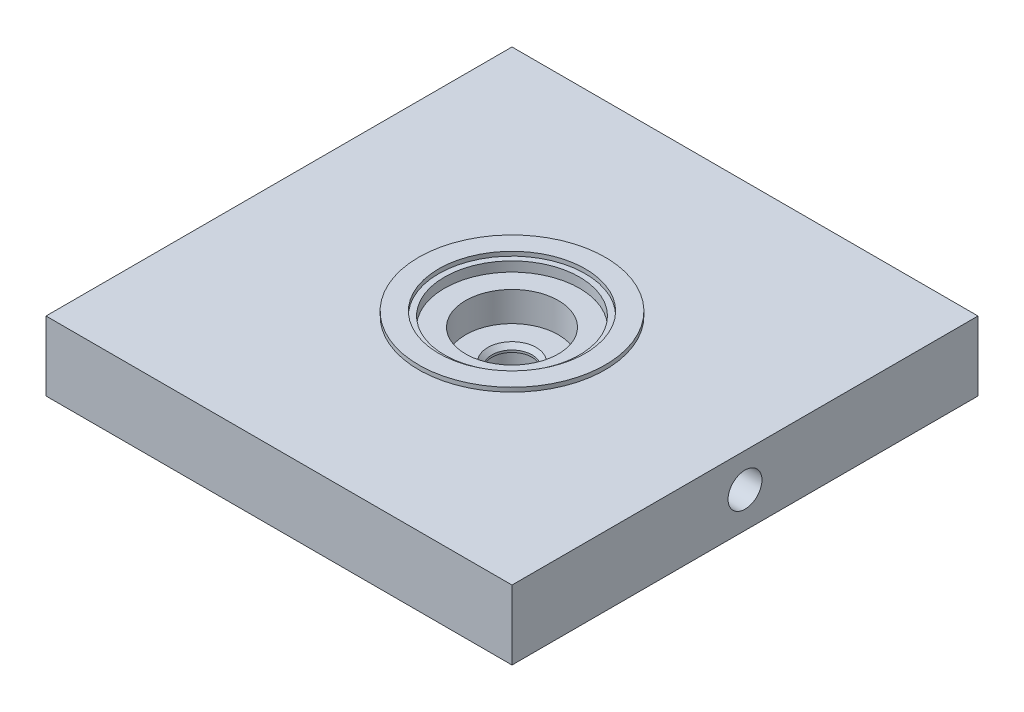
ISO-10303-21;
HEADER;
FILE_DESCRIPTION(('STEP AP214'),'2;1');
FILE_NAME('part.step','',(''),(''),'','','');
FILE_SCHEMA(('AUTOMOTIVE_DESIGN { 1 0 10303 214 1 1 1 1 }'));
ENDSEC;
DATA;
#1=APPLICATION_CONTEXT('core data for automotive mechanical design processes');
#2=APPLICATION_PROTOCOL_DEFINITION('international standard','automotive_design',2000,#1);
#3=PRODUCT_CONTEXT('',#1,'mechanical');
#4=PRODUCT('Part','Part','',(#3));
#5=PRODUCT_RELATED_PRODUCT_CATEGORY('part','',(#4));
#6=PRODUCT_DEFINITION_FORMATION('','',#4);
#7=PRODUCT_DEFINITION_CONTEXT('part definition',#1,'design');
#8=PRODUCT_DEFINITION('design','',#6,#7);
#9=PRODUCT_DEFINITION_SHAPE('','',#8);
#10=(LENGTH_UNIT() NAMED_UNIT(*) SI_UNIT(.MILLI.,.METRE.));
#11=(NAMED_UNIT(*) PLANE_ANGLE_UNIT() SI_UNIT($,.RADIAN.));
#12=(NAMED_UNIT(*) SI_UNIT($,.STERADIAN.) SOLID_ANGLE_UNIT());
#13=UNCERTAINTY_MEASURE_WITH_UNIT(LENGTH_MEASURE(1.E-05),#10,'distance_accuracy_value','');
#14=(GEOMETRIC_REPRESENTATION_CONTEXT(3) GLOBAL_UNCERTAINTY_ASSIGNED_CONTEXT((#13)) GLOBAL_UNIT_ASSIGNED_CONTEXT((#10,
#11,#12)) REPRESENTATION_CONTEXT('',''));
#15=CARTESIAN_POINT('',(0.,0.,0.));
#16=DIRECTION('',(0.,0.,1.));
#17=DIRECTION('',(1.,0.,0.));
#18=AXIS2_PLACEMENT_3D('',#15,#16,#17);
#19=CARTESIAN_POINT('',(0.,-3.5,0.));
#20=DIRECTION('',(0.,1.,0.));
#21=DIRECTION('',(-1.,0.,0.));
#22=AXIS2_PLACEMENT_3D('',#19,#20,#21);
#23=PLANE('',#22);
#24=CARTESIAN_POINT('',(0.,-3.5,0.));
#25=DIRECTION('',(0.,1.,0.));
#26=DIRECTION('',(-1.,0.,0.));
#27=AXIS2_PLACEMENT_3D('',#24,#25,#26);
#28=CIRCLE('',#27,5.47);
#29=CARTESIAN_POINT('',(5.13258219612701,-3.5,1.89142803193778));
#30=VERTEX_POINT('',#29);
#31=CARTESIAN_POINT('',(5.13258219612701,-3.5,-1.89142803193777));
#32=VERTEX_POINT('',#31);
#33=EDGE_CURVE('E111',#30,#32,#28,.T.);
#34=ORIENTED_EDGE('',*,*,#33,.T.);
#35=EDGE_CURVE('E113',#32,#30,#28,.T.);
#36=ORIENTED_EDGE('',*,*,#35,.T.);
#37=EDGE_LOOP('',(#34,#36));
#38=FACE_BOUND('',#37,.T.);
#39=CARTESIAN_POINT('',(0.,-3.5,0.));
#40=DIRECTION('',(0.,1.,0.));
#41=DIRECTION('',(-1.,0.,0.));
#42=AXIS2_PLACEMENT_3D('',#39,#40,#41);
#43=CIRCLE('',#42,2.86451);
#44=CARTESIAN_POINT('',(-2.86451,-3.5,0.));
#45=VERTEX_POINT('',#44);
#46=EDGE_CURVE('E12',#45,#45,#43,.T.);
#47=ORIENTED_EDGE('',*,*,#46,.F.);
#48=EDGE_LOOP('',(#47));
#49=FACE_BOUND('',#48,.T.);
#50=ADVANCED_FACE('F56',(#38,#49),#23,.T.);
#51=CARTESIAN_POINT('',(0.,-4.,0.));
#52=DIRECTION('',(0.,1.,0.));
#53=DIRECTION('',(-1.,0.,0.));
#54=AXIS2_PLACEMENT_3D('',#51,#52,#53);
#55=CONICAL_SURFACE('',#54,2.36451,0.785398163397445);
#56=ORIENTED_EDGE('',*,*,#46,.T.);
#57=EDGE_LOOP('',(#56));
#58=FACE_BOUND('',#57,.T.);
#59=CARTESIAN_POINT('',(0.,-4.,0.));
#60=DIRECTION('',(0.,1.,0.));
#61=DIRECTION('',(-1.,0.,0.));
#62=AXIS2_PLACEMENT_3D('',#59,#60,#61);
#63=CIRCLE('',#62,2.36451);
#64=CARTESIAN_POINT('',(-2.36451,-4.,0.));
#65=VERTEX_POINT('',#64);
#66=EDGE_CURVE('E63',#65,#65,#63,.T.);
#67=ORIENTED_EDGE('',*,*,#66,.F.);
#68=EDGE_LOOP('',(#67));
#69=FACE_BOUND('',#68,.T.);
#70=ADVANCED_FACE('F164',(#58,#69),#55,.F.);
#71=CARTESIAN_POINT('',(0.,0.,0.));
#72=DIRECTION('',(0.,1.,0.));
#73=DIRECTION('',(-1.,0.,0.));
#74=AXIS2_PLACEMENT_3D('',#71,#72,#73);
#75=CYLINDRICAL_SURFACE('',#74,2.36451);
#76=CARTESIAN_POINT('',(0.,-4.25,0.));
#77=DIRECTION('',(0.,1.,0.));
#78=DIRECTION('',(-1.,0.,0.));
#79=AXIS2_PLACEMENT_3D('',#76,#77,#78);
#80=CIRCLE('',#79,2.36451);
#81=CARTESIAN_POINT('',(-2.36451,-4.25,0.));
#82=VERTEX_POINT('',#81);
#83=EDGE_CURVE('E157',#82,#82,#80,.T.);
#84=ORIENTED_EDGE('',*,*,#83,.F.);
#85=EDGE_LOOP('',(#84));
#86=FACE_BOUND('',#85,.T.);
#87=ORIENTED_EDGE('',*,*,#66,.T.);
#88=EDGE_LOOP('',(#87));
#89=FACE_BOUND('',#88,.T.);
#90=ADVANCED_FACE('F162',(#86,#89),#75,.F.);
#91=CARTESIAN_POINT('',(0.,-4.25,0.));
#92=DIRECTION('',(0.,1.,0.));
#93=DIRECTION('',(-1.,0.,0.));
#94=AXIS2_PLACEMENT_3D('',#91,#92,#93);
#95=PLANE('',#94);
#96=CARTESIAN_POINT('',(0.,-4.25,0.));
#97=DIRECTION('',(0.,1.,0.));
#98=DIRECTION('',(-1.,0.,0.));
#99=AXIS2_PLACEMENT_3D('',#96,#97,#98);
#100=CIRCLE('',#99,3.06451);
#101=CARTESIAN_POINT('',(-3.06451,-4.25,0.));
#102=VERTEX_POINT('',#101);
#103=EDGE_CURVE('E154',#102,#102,#100,.T.);
#104=ORIENTED_EDGE('',*,*,#103,.F.);
#105=EDGE_LOOP('',(#104));
#106=FACE_BOUND('',#105,.T.);
#107=ORIENTED_EDGE('',*,*,#83,.T.);
#108=EDGE_LOOP('',(#107));
#109=FACE_BOUND('',#108,.T.);
#110=ADVANCED_FACE('F170',(#106,#109),#95,.F.);
#111=CARTESIAN_POINT('',(0.,0.,0.));
#112=DIRECTION('',(0.,1.,0.));
#113=DIRECTION('',(-1.,0.,0.));
#114=AXIS2_PLACEMENT_3D('',#111,#112,#113);
#115=CYLINDRICAL_SURFACE('',#114,3.06451);
#116=CARTESIAN_POINT('',(0.,-6.03,0.));
#117=DIRECTION('',(0.,1.,0.));
#118=DIRECTION('',(-1.,0.,0.));
#119=AXIS2_PLACEMENT_3D('',#116,#117,#118);
#120=CIRCLE('',#119,3.06451);
#121=CARTESIAN_POINT('',(-3.06451,-6.03,0.));
#122=VERTEX_POINT('',#121);
#123=EDGE_CURVE('E151',#122,#122,#120,.T.);
#124=ORIENTED_EDGE('',*,*,#123,.F.);
#125=EDGE_LOOP('',(#124));
#126=FACE_BOUND('',#125,.T.);
#127=ORIENTED_EDGE('',*,*,#103,.T.);
#128=EDGE_LOOP('',(#127));
#129=FACE_BOUND('',#128,.T.);
#130=ADVANCED_FACE('F177',(#126,#129),#115,.F.);
#131=CARTESIAN_POINT('',(0.,-6.03,0.));
#132=DIRECTION('',(0.,-1.,0.));
#133=DIRECTION('',(1.,0.,0.));
#134=AXIS2_PLACEMENT_3D('',#131,#132,#133);
#135=PLANE('',#134);
#136=CARTESIAN_POINT('',(0.,-6.03,0.));
#137=DIRECTION('',(0.,1.,0.));
#138=DIRECTION('',(-1.,0.,0.));
#139=AXIS2_PLACEMENT_3D('',#136,#137,#138);
#140=CIRCLE('',#139,0.25);
#141=CARTESIAN_POINT('',(-0.249999999999999,-6.03,0.));
#142=VERTEX_POINT('',#141);
#143=EDGE_CURVE('E148',#142,#142,#140,.T.);
#144=ORIENTED_EDGE('',*,*,#143,.F.);
#145=EDGE_LOOP('',(#144));
#146=FACE_BOUND('',#145,.T.);
#147=ORIENTED_EDGE('',*,*,#123,.T.);
#148=EDGE_LOOP('',(#147));
#149=FACE_BOUND('',#148,.T.);
#150=ADVANCED_FACE('F181',(#146,#149),#135,.F.);
#151=CARTESIAN_POINT('',(0.,0.,0.));
#152=DIRECTION('',(0.,1.,0.));
#153=DIRECTION('',(-1.,0.,0.));
#154=AXIS2_PLACEMENT_3D('',#151,#152,#153);
#155=CYLINDRICAL_SURFACE('',#154,0.25);
#156=CARTESIAN_POINT('',(0.,-7.03,0.));
#157=DIRECTION('',(0.,1.,0.));
#158=DIRECTION('',(-1.,0.,0.));
#159=AXIS2_PLACEMENT_3D('',#156,#157,#158);
#160=CIRCLE('',#159,0.25);
#161=CARTESIAN_POINT('',(-0.249999999999999,-7.03,0.));
#162=VERTEX_POINT('',#161);
#163=EDGE_CURVE('E145',#162,#162,#160,.T.);
#164=ORIENTED_EDGE('',*,*,#163,.F.);
#165=EDGE_LOOP('',(#164));
#166=FACE_BOUND('',#165,.T.);
#167=ORIENTED_EDGE('',*,*,#143,.T.);
#168=EDGE_LOOP('',(#167));
#169=FACE_BOUND('',#168,.T.);
#170=ADVANCED_FACE('F185',(#166,#169),#155,.F.);
#171=CARTESIAN_POINT('',(0.,-7.03,0.));
#172=DIRECTION('',(0.,1.,0.));
#173=DIRECTION('',(-1.,0.,0.));
#174=AXIS2_PLACEMENT_3D('',#171,#172,#173);
#175=PLANE('',#174);
#176=ORIENTED_EDGE('',*,*,#163,.T.);
#177=EDGE_LOOP('',(#176));
#178=FACE_BOUND('',#177,.T.);
#179=DIRECTION('',(0.,0.,1.));
#180=VECTOR('',#179,1.);
#181=CARTESIAN_POINT('',(27.5,-7.02999999999999,27.5));
#182=LINE('',#181,#180);
#183=CARTESIAN_POINT('',(27.5,-7.02999999999999,-27.5));
#184=VERTEX_POINT('',#183);
#185=CARTESIAN_POINT('',(27.5,-7.02999999999999,27.5));
#186=VERTEX_POINT('',#185);
#187=EDGE_CURVE('E77',#184,#186,#182,.T.);
#188=ORIENTED_EDGE('',*,*,#187,.T.);
#189=DIRECTION('',(-1.,0.,0.));
#190=VECTOR('',#189,1.);
#191=CARTESIAN_POINT('',(-27.5,-7.02999999999999,27.5));
#192=LINE('',#191,#190);
#193=CARTESIAN_POINT('',(-27.5,-7.02999999999999,27.5));
#194=VERTEX_POINT('',#193);
#195=EDGE_CURVE('E252',#186,#194,#192,.T.);
#196=ORIENTED_EDGE('',*,*,#195,.T.);
#197=DIRECTION('',(0.,0.,1.));
#198=VECTOR('',#197,1.);
#199=CARTESIAN_POINT('',(-27.5,-7.02999999999999,27.5));
#200=LINE('',#199,#198);
#201=CARTESIAN_POINT('',(-27.5,-7.02999999999999,-27.5));
#202=VERTEX_POINT('',#201);
#203=EDGE_CURVE('E249',#202,#194,#200,.T.);
#204=ORIENTED_EDGE('',*,*,#203,.F.);
#205=DIRECTION('',(-1.,0.,0.));
#206=VECTOR('',#205,1.);
#207=CARTESIAN_POINT('',(-27.5,-7.02999999999999,-27.5));
#208=LINE('',#207,#206);
#209=EDGE_CURVE('E117',#184,#202,#208,.T.);
#210=ORIENTED_EDGE('',*,*,#209,.F.);
#211=EDGE_LOOP('',(#188,#196,#204,#210));
#212=FACE_BOUND('',#211,.T.);
#213=ADVANCED_FACE('F189',(#178,#212),#175,.F.);
#214=CARTESIAN_POINT('',(0.,1.15,0.));
#215=DIRECTION('',(0.,1.,0.));
#216=DIRECTION('',(-1.,0.,0.));
#217=AXIS2_PLACEMENT_3D('',#214,#215,#216);
#218=PLANE('',#217);
#219=CARTESIAN_POINT('',(0.,1.15,0.));
#220=DIRECTION('',(0.,1.,0.));
#221=DIRECTION('',(-1.,0.,0.));
#222=AXIS2_PLACEMENT_3D('',#219,#220,#221);
#223=CIRCLE('',#222,11.01);
#224=CARTESIAN_POINT('',(-11.01,1.15,0.));
#225=VERTEX_POINT('',#224);
#226=EDGE_CURVE('E142',#225,#225,#223,.T.);
#227=ORIENTED_EDGE('',*,*,#226,.F.);
#228=EDGE_LOOP('',(#227));
#229=FACE_BOUND('',#228,.T.);
#230=DIRECTION('',(1.,0.,0.));
#231=VECTOR('',#230,1.);
#232=CARTESIAN_POINT('',(-27.5,1.15,-27.5));
#233=LINE('',#232,#231);
#234=CARTESIAN_POINT('',(-27.5,1.15,-27.5));
#235=VERTEX_POINT('',#234);
#236=CARTESIAN_POINT('',(27.5,1.15,-27.5));
#237=VERTEX_POINT('',#236);
#238=EDGE_CURVE('E112',#235,#237,#233,.T.);
#239=ORIENTED_EDGE('',*,*,#238,.F.);
#240=DIRECTION('',(0.,0.,-1.));
#241=VECTOR('',#240,1.);
#242=CARTESIAN_POINT('',(-27.5,1.15,27.5));
#243=LINE('',#242,#241);
#244=CARTESIAN_POINT('',(-27.5,1.15,27.5));
#245=VERTEX_POINT('',#244);
#246=EDGE_CURVE('E265',#245,#235,#243,.T.);
#247=ORIENTED_EDGE('',*,*,#246,.F.);
#248=DIRECTION('',(1.,0.,0.));
#249=VECTOR('',#248,1.);
#250=CARTESIAN_POINT('',(-27.5,1.15,27.5));
#251=LINE('',#250,#249);
#252=CARTESIAN_POINT('',(27.5,1.15,27.5));
#253=VERTEX_POINT('',#252);
#254=EDGE_CURVE('E262',#245,#253,#251,.T.);
#255=ORIENTED_EDGE('',*,*,#254,.T.);
#256=DIRECTION('',(0.,0.,-1.));
#257=VECTOR('',#256,1.);
#258=CARTESIAN_POINT('',(27.5,1.15,27.5));
#259=LINE('',#258,#257);
#260=EDGE_CURVE('E259',#253,#237,#259,.T.);
#261=ORIENTED_EDGE('',*,*,#260,.T.);
#262=EDGE_LOOP('',(#239,#247,#255,#261));
#263=FACE_BOUND('',#262,.T.);
#264=ADVANCED_FACE('F193',(#229,#263),#218,.T.);
#265=CARTESIAN_POINT('',(0.,0.,0.));
#266=DIRECTION('',(0.,1.,0.));
#267=DIRECTION('',(-1.,0.,0.));
#268=AXIS2_PLACEMENT_3D('',#265,#266,#267);
#269=CYLINDRICAL_SURFACE('',#268,11.01);
#270=CARTESIAN_POINT('',(0.,1.65,0.));
#271=DIRECTION('',(0.,1.,0.));
#272=DIRECTION('',(-1.,0.,0.));
#273=AXIS2_PLACEMENT_3D('',#270,#271,#272);
#274=CIRCLE('',#273,11.01);
#275=CARTESIAN_POINT('',(-11.01,1.65,0.));
#276=VERTEX_POINT('',#275);
#277=EDGE_CURVE('E139',#276,#276,#274,.T.);
#278=ORIENTED_EDGE('',*,*,#277,.F.);
#279=EDGE_LOOP('',(#278));
#280=FACE_BOUND('',#279,.T.);
#281=ORIENTED_EDGE('',*,*,#226,.T.);
#282=EDGE_LOOP('',(#281));
#283=FACE_BOUND('',#282,.T.);
#284=ADVANCED_FACE('F197',(#280,#283),#269,.T.);
#285=CARTESIAN_POINT('',(0.,1.65,0.));
#286=DIRECTION('',(0.,-1.,0.));
#287=DIRECTION('',(1.,0.,0.));
#288=AXIS2_PLACEMENT_3D('',#285,#286,#287);
#289=PLANE('',#288);
#290=CARTESIAN_POINT('',(0.,1.65,0.));
#291=DIRECTION('',(0.,1.,0.));
#292=DIRECTION('',(-1.,0.,0.));
#293=AXIS2_PLACEMENT_3D('',#290,#291,#292);
#294=CIRCLE('',#293,8.65);
#295=CARTESIAN_POINT('',(-8.65,1.65,0.));
#296=VERTEX_POINT('',#295);
#297=EDGE_CURVE('E136',#296,#296,#294,.T.);
#298=ORIENTED_EDGE('',*,*,#297,.F.);
#299=EDGE_LOOP('',(#298));
#300=FACE_BOUND('',#299,.T.);
#301=ORIENTED_EDGE('',*,*,#277,.T.);
#302=EDGE_LOOP('',(#301));
#303=FACE_BOUND('',#302,.T.);
#304=ADVANCED_FACE('F201',(#300,#303),#289,.F.);
#305=CARTESIAN_POINT('',(0.,0.,0.));
#306=DIRECTION('',(0.,1.,0.));
#307=DIRECTION('',(-1.,0.,0.));
#308=AXIS2_PLACEMENT_3D('',#305,#306,#307);
#309=CYLINDRICAL_SURFACE('',#308,8.65);
#310=ORIENTED_EDGE('',*,*,#297,.T.);
#311=EDGE_LOOP('',(#310));
#312=FACE_BOUND('',#311,.T.);
#313=CARTESIAN_POINT('',(0.,1.15,0.));
#314=DIRECTION('',(0.,1.,0.));
#315=DIRECTION('',(-1.,0.,0.));
#316=AXIS2_PLACEMENT_3D('',#313,#314,#315);
#317=CIRCLE('',#316,8.65);
#318=CARTESIAN_POINT('',(-8.65,1.15,0.));
#319=VERTEX_POINT('',#318);
#320=EDGE_CURVE('E133',#319,#319,#317,.T.);
#321=ORIENTED_EDGE('',*,*,#320,.F.);
#322=EDGE_LOOP('',(#321));
#323=FACE_BOUND('',#322,.T.);
#324=ADVANCED_FACE('F205',(#312,#323),#309,.F.);
#325=CARTESIAN_POINT('',(0.,1.15,0.));
#326=DIRECTION('',(0.,-1.,0.));
#327=DIRECTION('',(1.,0.,0.));
#328=AXIS2_PLACEMENT_3D('',#325,#326,#327);
#329=PLANE('',#328);
#330=CARTESIAN_POINT('',(0.,1.15,0.));
#331=DIRECTION('',(0.,1.,0.));
#332=DIRECTION('',(-1.,0.,0.));
#333=AXIS2_PLACEMENT_3D('',#330,#331,#332);
#334=CIRCLE('',#333,7.97);
#335=CARTESIAN_POINT('',(-7.97,1.15,0.));
#336=VERTEX_POINT('',#335);
#337=EDGE_CURVE('E130',#336,#336,#334,.T.);
#338=ORIENTED_EDGE('',*,*,#337,.F.);
#339=EDGE_LOOP('',(#338));
#340=FACE_BOUND('',#339,.T.);
#341=ORIENTED_EDGE('',*,*,#320,.T.);
#342=EDGE_LOOP('',(#341));
#343=FACE_BOUND('',#342,.T.);
#344=ADVANCED_FACE('F209',(#340,#343),#329,.F.);
#345=CARTESIAN_POINT('',(0.,0.,0.));
#346=DIRECTION('',(0.,1.,0.));
#347=DIRECTION('',(-1.,0.,0.));
#348=AXIS2_PLACEMENT_3D('',#345,#346,#347);
#349=CYLINDRICAL_SURFACE('',#348,7.97);
#350=CARTESIAN_POINT('',(0.,0.,0.));
#351=DIRECTION('',(0.,1.,0.));
#352=DIRECTION('',(-1.,0.,0.));
#353=AXIS2_PLACEMENT_3D('',#350,#351,#352);
#354=CIRCLE('',#353,7.97);
#355=CARTESIAN_POINT('',(-7.97,0.,0.));
#356=VERTEX_POINT('',#355);
#357=EDGE_CURVE('E122',#356,#356,#354,.T.);
#358=ORIENTED_EDGE('',*,*,#357,.F.);
#359=EDGE_LOOP('',(#358));
#360=FACE_BOUND('',#359,.T.);
#361=ORIENTED_EDGE('',*,*,#337,.T.);
#362=EDGE_LOOP('',(#361));
#363=FACE_BOUND('',#362,.T.);
#364=ADVANCED_FACE('F213',(#360,#363),#349,.F.);
#365=CARTESIAN_POINT('',(0.,0.,0.));
#366=DIRECTION('',(0.,-1.,0.));
#367=DIRECTION('',(1.,0.,0.));
#368=AXIS2_PLACEMENT_3D('',#365,#366,#367);
#369=PLANE('',#368);
#370=CARTESIAN_POINT('',(0.,0.,0.));
#371=DIRECTION('',(0.,1.,0.));
#372=DIRECTION('',(-1.,0.,0.));
#373=AXIS2_PLACEMENT_3D('',#370,#371,#372);
#374=CIRCLE('',#373,5.47);
#375=CARTESIAN_POINT('',(-5.47,0.,0.));
#376=VERTEX_POINT('',#375);
#377=EDGE_CURVE('E120',#376,#376,#374,.T.);
#378=ORIENTED_EDGE('',*,*,#377,.F.);
#379=EDGE_LOOP('',(#378));
#380=FACE_BOUND('',#379,.T.);
#381=ORIENTED_EDGE('',*,*,#357,.T.);
#382=EDGE_LOOP('',(#381));
#383=FACE_BOUND('',#382,.T.);
#384=ADVANCED_FACE('F217',(#380,#383),#369,.F.);
#385=CARTESIAN_POINT('',(0.,0.,0.));
#386=DIRECTION('',(0.,1.,0.));
#387=DIRECTION('',(-1.,0.,0.));
#388=AXIS2_PLACEMENT_3D('',#385,#386,#387);
#389=CYLINDRICAL_SURFACE('',#388,5.47);
#390=ORIENTED_EDGE('',*,*,#35,.F.);
#391=CARTESIAN_POINT('',(5.09125721212354,-2.85,-2.));
#392=CARTESIAN_POINT('',(5.091254391583,-2.95822874439323,-2.00000311787075));
#393=CARTESIAN_POINT('',(5.0947458031395,-3.06643635341194,-1.99118555863275));
#394=CARTESIAN_POINT('',(5.10824227856895,-3.27960218690843,-1.9562989827442));
#395=CARTESIAN_POINT('',(5.11824741211118,-3.38456037661857,-1.93022978157395));
#396=CARTESIAN_POINT('',(5.14348972778412,-3.58809396760024,-1.86191353648647));
#397=CARTESIAN_POINT('',(5.15871491583673,-3.6866833905535,-1.8197035537006));
#398=CARTESIAN_POINT('',(5.19266297453711,-3.87541871070557,-1.72043426403698));
#399=CARTESIAN_POINT('',(5.21138683747467,-3.9655622015627,-1.66337074260817));
#400=CARTESIAN_POINT('',(5.25121304819841,-4.13910197269869,-1.53312904852932));
#401=CARTESIAN_POINT('',(5.27238298030415,-4.22204276711159,-1.45936447726709));
#402=CARTESIAN_POINT('',(5.3141505311624,-4.37469536278533,-1.29906047330386));
#403=CARTESIAN_POINT('',(5.33474803471528,-4.44440451743838,-1.21251849099186));
#404=CARTESIAN_POINT('',(5.37384837833365,-4.57077892548405,-1.02568860727122));
#405=CARTESIAN_POINT('',(5.39226268081091,-4.62695325603985,-0.925048455849131));
#406=CARTESIAN_POINT('',(5.42411325486745,-4.72138723957441,-0.714955091629662));
#407=CARTESIAN_POINT('',(5.43755116111779,-4.75965277641308,-0.605504787241842));
#408=CARTESIAN_POINT('',(5.45745535738874,-4.81559794248077,-0.385683713500258));
#409=CARTESIAN_POINT('',(5.46418609117968,-4.83406082668,-0.275536691986404));
#410=CARTESIAN_POINT('',(5.47086418080377,-4.85238175376891,-0.0535158238973849));
#411=CARTESIAN_POINT('',(5.47081363406816,-4.85224554930486,0.0583574780396732));
#412=CARTESIAN_POINT('',(5.46410566391451,-4.83383786835685,0.275057676490256));
#413=CARTESIAN_POINT('',(5.45775932846497,-4.8164202942535,0.379968387625696));
#414=CARTESIAN_POINT('',(5.43957678960932,-4.76537496938507,0.585259840136865));
#415=CARTESIAN_POINT('',(5.42774019999733,-4.73174607824622,0.685640262289248));
#416=CARTESIAN_POINT('',(5.39954547617309,-4.64881301862834,0.880720841339732));
#417=CARTESIAN_POINT('',(5.38312514800252,-4.59929172404407,0.975319332901395));
#418=CARTESIAN_POINT('',(5.34743587513321,-4.48616834330889,1.15509380481729));
#419=CARTESIAN_POINT('',(5.32816603809338,-4.42256184317427,1.24026681886469));
#420=CARTESIAN_POINT('',(5.28750372895185,-4.27891410915316,1.40381655675838));
#421=CARTESIAN_POINT('',(5.2660528155196,-4.1981531132989,1.48154753595714));
#422=CARTESIAN_POINT('',(5.22431799588744,-4.02459930331834,1.62259811876546));
#423=CARTESIAN_POINT('',(5.20403435449521,-3.93180377444815,1.68591446182186));
#424=CARTESIAN_POINT('',(5.1665732063304,-3.73438648145654,1.79748915101201));
#425=CARTESIAN_POINT('',(5.14946666737524,-3.62956380000466,1.84541772622792));
#426=CARTESIAN_POINT('',(5.12111555250892,-3.41254617078063,1.92270393349013));
#427=CARTESIAN_POINT('',(5.10986790807261,-3.30035511684685,1.95207128847411));
#428=CARTESIAN_POINT('',(5.09522490557763,-3.07814011651864,1.98996899058287));
#429=CARTESIAN_POINT('',(5.0914455360271,-2.96831563391682,1.99951970247695));
#430=CARTESIAN_POINT('',(5.09108292545212,-2.74859215933858,2.00044456355214));
#431=CARTESIAN_POINT('',(5.09449801076061,-2.63869319063576,1.99182294021645));
#432=CARTESIAN_POINT('',(5.10775110804571,-2.42702959176674,1.95757131983748));
#433=CARTESIAN_POINT('',(5.11729829545141,-2.3251201879868,1.93271062183873));
#434=CARTESIAN_POINT('',(5.14140073568154,-2.12695922016301,1.8676438614441));
#435=CARTESIAN_POINT('',(5.15595698351885,-2.03070878468253,1.82743475002565));
#436=CARTESIAN_POINT('',(5.18908745576638,-1.84272169357703,1.73116863875947));
#437=CARTESIAN_POINT('',(5.20778818473713,-1.75127506681583,1.6745900743627));
#438=CARTESIAN_POINT('',(5.2468805055381,-1.57880986440526,1.54775419216593));
#439=CARTESIAN_POINT('',(5.26727268787594,-1.49779495600737,1.47749208563269));
#440=CARTESIAN_POINT('',(5.30892237257686,-1.34347780906796,1.32031398442686));
#441=CARTESIAN_POINT('',(5.3301588178306,-1.27092517268943,1.23265397762494));
#442=CARTESIAN_POINT('',(5.36992914267361,-1.14147960249035,1.04588012084361));
#443=CARTESIAN_POINT('',(5.3884630436294,-1.08458654486076,0.946766361429589));
#444=CARTESIAN_POINT('',(5.42070617450834,-0.988494767614,0.740083109979058));
#445=CARTESIAN_POINT('',(5.43443626196752,-0.949219339358069,0.632552717596514));
#446=CARTESIAN_POINT('',(5.45560186081747,-0.889520464354252,0.411798616296537));
#447=CARTESIAN_POINT('',(5.46304016639917,-0.869088648761654,0.298577458350187));
#448=CARTESIAN_POINT('',(5.47053174266184,-0.848525691967041,0.0764487569713347));
#449=CARTESIAN_POINT('',(5.47097326168379,-0.847327249981678,-0.0323478136504608));
#450=CARTESIAN_POINT('',(5.46542063451023,-0.862546003612983,-0.248523239176891));
#451=CARTESIAN_POINT('',(5.45942720095134,-0.878961248607789,-0.355902249735728));
#452=CARTESIAN_POINT('',(5.44184782789745,-0.928199445651248,-0.563775741311425));
#453=CARTESIAN_POINT('',(5.43038938589713,-0.960648915589563,-0.664370278667652));
#454=CARTESIAN_POINT('',(5.4030702122477,-1.04066931086258,-0.858703304691961));
#455=CARTESIAN_POINT('',(5.38720865040618,-1.08824308807687,-0.952440496216742));
#456=CARTESIAN_POINT('',(5.35187184675061,-1.19938910821711,-1.13460633102341));
#457=CARTESIAN_POINT('',(5.33227502939404,-1.26353772444036,-1.22265931346974));
#458=CARTESIAN_POINT('',(5.29188759207097,-1.40508776823158,-1.38708561693197));
#459=CARTESIAN_POINT('',(5.27109655679841,-1.4824938250345,-1.46345484051626));
#460=CARTESIAN_POINT('',(5.22941053307888,-1.65292749023672,-1.60622991910823));
#461=CARTESIAN_POINT('',(5.20856143132448,-1.74653906390188,-1.67195466462429));
#462=CARTESIAN_POINT('',(5.17031007481629,-1.94413922460117,-1.78674830898503));
#463=CARTESIAN_POINT('',(5.15290785751984,-2.04812792438517,-1.83581702683261));
#464=CARTESIAN_POINT('',(5.1234599802742,-2.26618074741781,-1.9164977086428));
#465=CARTESIAN_POINT('',(5.11154494080527,-2.38042005020912,-1.94768792931755));
#466=CARTESIAN_POINT('',(5.0954473114292,-2.61311630576787,-1.98943146679323));
#467=CARTESIAN_POINT('',(5.09126029849717,-2.73157080643016,-1.99999658827309));
#468=CARTESIAN_POINT('',(5.09125721212354,-2.85,-2.));
#469=B_SPLINE_CURVE_WITH_KNOTS('',3,(#391,#392,#393,#394,#395,#396,#397,#398,#399,#400,#401,
#402,#403,#404,#405,#406,#407,#408,#409,#410,#411,#412,#413,#414,#415,#416,#417,#418,#419,#420,
#421,#422,#423,#424,#425,#426,#427,#428,#429,#430,#431,#432,#433,#434,#435,#436,#437,#438,#439,
#440,#441,#442,#443,#444,#445,#446,#447,#448,#449,#450,#451,#452,#453,#454,#455,#456,#457,#458,
#459,#460,#461,#462,#463,#464,#465,#466,#467,#468),.UNSPECIFIED.,.T.,.F.,(4,2,2,2,2,2,2,2,2,2,2,
2,2,2,2,2,2,2,2,2,2,2,2,2,2,2,2,2,2,2,2,2,2,2,2,2,2,2,4),(0.,0.324245795696212,
0.648495059508564,0.972004236516722,1.29560530644256,1.63309175700794,1.97064564103001,
2.31904241433853,2.66732464283837,3.00125626440331,3.33508460208275,3.65320013005055,
3.97133803889875,4.29402199899695,4.61680722438877,4.95762986381741,5.29852952001108,
5.64631077776172,5.99390970568007,6.32311537729542,6.65224447329062,6.96681336953998,
7.28144478868395,7.60747955029062,7.93362861769946,8.27925650024053,8.62488165007144,
8.96898695379721,9.31293935942341,9.63773470902936,9.96249409299519,10.2800221980419,
10.5976102125806,10.928230040893,11.2589655513307,11.60608754744,11.9532133155209,
12.3082221952715,12.6630278277123),.UNSPECIFIED.);
#470=EDGE_CURVE('E100',#30,#32,#469,.T.);
#471=ORIENTED_EDGE('',*,*,#470,.F.);
#472=EDGE_LOOP('',(#390,#471));
#473=FACE_BOUND('',#472,.T.);
#474=ORIENTED_EDGE('',*,*,#377,.T.);
#475=EDGE_LOOP('',(#474));
#476=FACE_BOUND('',#475,.T.);
#477=ADVANCED_FACE('F114',(#473,#476),#389,.F.);
#478=CARTESIAN_POINT('',(-27.5,-84.8117459305202,27.5));
#479=DIRECTION('',(1.,0.,0.));
#480=DIRECTION('',(0.,0.,-1.));
#481=AXIS2_PLACEMENT_3D('',#478,#479,#480);
#482=PLANE('',#481);
#483=DIRECTION('',(0.,1.,0.));
#484=VECTOR('',#483,1.);
#485=CARTESIAN_POINT('',(-27.5,-84.8117459305202,-27.5));
#486=LINE('',#485,#484);
#487=EDGE_CURVE('E268',#202,#235,#486,.T.);
#488=ORIENTED_EDGE('',*,*,#487,.F.);
#489=ORIENTED_EDGE('',*,*,#203,.T.);
#490=DIRECTION('',(0.,1.,0.));
#491=VECTOR('',#490,1.);
#492=CARTESIAN_POINT('',(-27.5,-84.8117459305202,27.5));
#493=LINE('',#492,#491);
#494=EDGE_CURVE('E270',#194,#245,#493,.T.);
#495=ORIENTED_EDGE('',*,*,#494,.T.);
#496=ORIENTED_EDGE('',*,*,#246,.T.);
#497=EDGE_LOOP('',(#488,#489,#495,#496));
#498=FACE_BOUND('',#497,.T.);
#499=ADVANCED_FACE('F224',(#498),#482,.F.);
#500=CARTESIAN_POINT('',(-27.5,-84.8117459305202,27.5));
#501=DIRECTION('',(0.,0.,1.));
#502=DIRECTION('',(1.,0.,0.));
#503=AXIS2_PLACEMENT_3D('',#500,#501,#502);
#504=PLANE('',#503);
#505=ORIENTED_EDGE('',*,*,#195,.F.);
#506=DIRECTION('',(0.,1.,0.));
#507=VECTOR('',#506,1.);
#508=CARTESIAN_POINT('',(27.5,-84.8117459305202,27.5));
#509=LINE('',#508,#507);
#510=EDGE_CURVE('E271',#186,#253,#509,.T.);
#511=ORIENTED_EDGE('',*,*,#510,.T.);
#512=ORIENTED_EDGE('',*,*,#254,.F.);
#513=ORIENTED_EDGE('',*,*,#494,.F.);
#514=EDGE_LOOP('',(#505,#511,#512,#513));
#515=FACE_BOUND('',#514,.T.);
#516=ADVANCED_FACE('F232',(#515),#504,.T.);
#517=CARTESIAN_POINT('',(27.5,-84.8117459305202,27.5));
#518=DIRECTION('',(1.,0.,0.));
#519=DIRECTION('',(0.,0.,-1.));
#520=AXIS2_PLACEMENT_3D('',#517,#518,#519);
#521=PLANE('',#520);
#522=CARTESIAN_POINT('',(27.5,-2.85,0.));
#523=DIRECTION('',(1.,0.,0.));
#524=DIRECTION('',(0.,0.,-1.));
#525=AXIS2_PLACEMENT_3D('',#522,#523,#524);
#526=CIRCLE('',#525,2.);
#527=CARTESIAN_POINT('',(27.5,-2.85,-2.));
#528=VERTEX_POINT('',#527);
#529=EDGE_CURVE('E106',#528,#528,#526,.T.);
#530=ORIENTED_EDGE('',*,*,#529,.F.);
#531=EDGE_LOOP('',(#530));
#532=FACE_BOUND('',#531,.T.);
#533=ORIENTED_EDGE('',*,*,#187,.F.);
#534=DIRECTION('',(0.,1.,0.));
#535=VECTOR('',#534,1.);
#536=CARTESIAN_POINT('',(27.5,-84.8117459305202,-27.5));
#537=LINE('',#536,#535);
#538=EDGE_CURVE('E125',#184,#237,#537,.T.);
#539=ORIENTED_EDGE('',*,*,#538,.T.);
#540=ORIENTED_EDGE('',*,*,#260,.F.);
#541=ORIENTED_EDGE('',*,*,#510,.F.);
#542=EDGE_LOOP('',(#533,#539,#540,#541));
#543=FACE_BOUND('',#542,.T.);
#544=ADVANCED_FACE('F228',(#532,#543),#521,.T.);
#545=CARTESIAN_POINT('',(-27.5,-84.8117459305202,-27.5));
#546=DIRECTION('',(0.,0.,1.));
#547=DIRECTION('',(1.,0.,0.));
#548=AXIS2_PLACEMENT_3D('',#545,#546,#547);
#549=PLANE('',#548);
#550=ORIENTED_EDGE('',*,*,#538,.F.);
#551=ORIENTED_EDGE('',*,*,#209,.T.);
#552=ORIENTED_EDGE('',*,*,#487,.T.);
#553=ORIENTED_EDGE('',*,*,#238,.T.);
#554=EDGE_LOOP('',(#550,#551,#552,#553));
#555=FACE_BOUND('',#554,.T.);
#556=ADVANCED_FACE('F225',(#555),#549,.F.);
#557=CARTESIAN_POINT('',(-27.501,-2.85,0.));
#558=DIRECTION('',(1.,0.,0.));
#559=DIRECTION('',(0.,0.,-1.));
#560=AXIS2_PLACEMENT_3D('',#557,#558,#559);
#561=CYLINDRICAL_SURFACE('',#560,2.);
#562=EDGE_CURVE('E69',#32,#30,#469,.T.);
#563=ORIENTED_EDGE('',*,*,#562,.T.);
#564=ORIENTED_EDGE('',*,*,#470,.T.);
#565=EDGE_LOOP('',(#563,#564));
#566=FACE_BOUND('',#565,.T.);
#567=ORIENTED_EDGE('',*,*,#529,.T.);
#568=EDGE_LOOP('',(#567));
#569=FACE_BOUND('',#568,.T.);
#570=ADVANCED_FACE('F101',(#566,#569),#561,.F.);
#571=CARTESIAN_POINT('',(0.,0.,0.));
#572=DIRECTION('',(0.,1.,0.));
#573=DIRECTION('',(-1.,0.,0.));
#574=AXIS2_PLACEMENT_3D('',#571,#572,#573);
#575=CYLINDRICAL_SURFACE('',#574,5.47);
#576=ORIENTED_EDGE('',*,*,#562,.F.);
#577=ORIENTED_EDGE('',*,*,#33,.F.);
#578=EDGE_LOOP('',(#576,#577));
#579=FACE_BOUND('',#578,.T.);
#580=ADVANCED_FACE('F109',(#579),#575,.T.);
#581=CLOSED_SHELL('',(#50,#70,#90,#110,#130,#150,#170,#213,#264,#284,#304,#324,#344,#364,#384,
#477,#499,#516,#544,#556,#570,#580));
#582=MANIFOLD_SOLID_BREP('B2',#581);
#583=ADVANCED_BREP_SHAPE_REPRESENTATION('',(#18,#582),#14);
#584=SHAPE_DEFINITION_REPRESENTATION(#9,#583);
ENDSEC;
END-ISO-10303-21;
